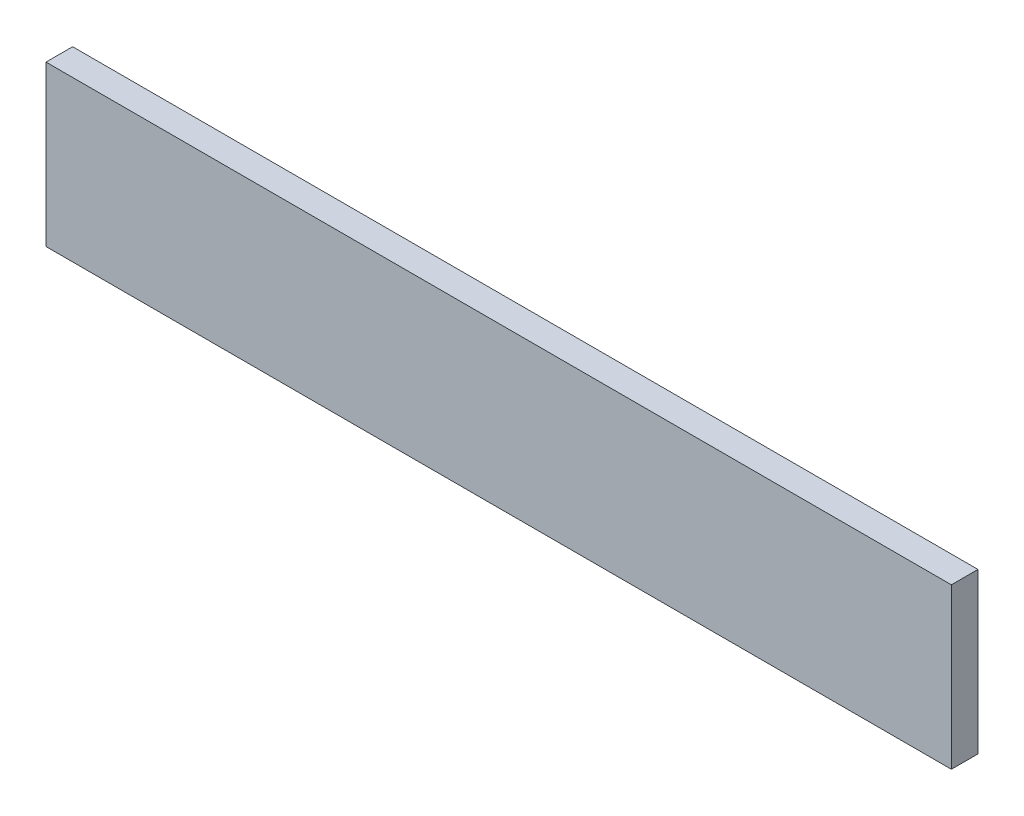
ISO-10303-21;
HEADER;
FILE_DESCRIPTION(('STEP AP214'),'2;1');
FILE_NAME('part.step','',(''),(''),'','','');
FILE_SCHEMA(('AUTOMOTIVE_DESIGN { 1 0 10303 214 1 1 1 1 }'));
ENDSEC;
DATA;
#1=APPLICATION_CONTEXT('core data for automotive mechanical design processes');
#2=APPLICATION_PROTOCOL_DEFINITION('international standard','automotive_design',2000,#1);
#3=PRODUCT_CONTEXT('',#1,'mechanical');
#4=PRODUCT('Part','Part','',(#3));
#5=PRODUCT_RELATED_PRODUCT_CATEGORY('part','',(#4));
#6=PRODUCT_DEFINITION_FORMATION('','',#4);
#7=PRODUCT_DEFINITION_CONTEXT('part definition',#1,'design');
#8=PRODUCT_DEFINITION('design','',#6,#7);
#9=PRODUCT_DEFINITION_SHAPE('','',#8);
#10=(LENGTH_UNIT() NAMED_UNIT(*) SI_UNIT(.MILLI.,.METRE.));
#11=(NAMED_UNIT(*) PLANE_ANGLE_UNIT() SI_UNIT($,.RADIAN.));
#12=(NAMED_UNIT(*) SI_UNIT($,.STERADIAN.) SOLID_ANGLE_UNIT());
#13=UNCERTAINTY_MEASURE_WITH_UNIT(LENGTH_MEASURE(1.E-05),#10,'distance_accuracy_value','');
#14=(GEOMETRIC_REPRESENTATION_CONTEXT(3) GLOBAL_UNCERTAINTY_ASSIGNED_CONTEXT((#13)) GLOBAL_UNIT_ASSIGNED_CONTEXT((#10,
#11,#12)) REPRESENTATION_CONTEXT('',''));
#15=CARTESIAN_POINT('',(0.,0.,0.));
#16=DIRECTION('',(0.,0.,1.));
#17=DIRECTION('',(1.,0.,0.));
#18=AXIS2_PLACEMENT_3D('',#15,#16,#17);
#19=CARTESIAN_POINT('',(0.,0.,6.35));
#20=DIRECTION('',(1.,0.,0.));
#21=DIRECTION('',(0.,0.,-1.));
#22=AXIS2_PLACEMENT_3D('',#19,#20,#21);
#23=PLANE('',#22);
#24=DIRECTION('',(0.,-1.,0.));
#25=VECTOR('',#24,1.);
#26=CARTESIAN_POINT('',(0.,0.,0.));
#27=LINE('',#26,#25);
#28=CARTESIAN_POINT('',(0.,38.1,0.));
#29=VERTEX_POINT('',#28);
#30=CARTESIAN_POINT('',(0.,0.,0.));
#31=VERTEX_POINT('',#30);
#32=EDGE_CURVE('E96',#29,#31,#27,.T.);
#33=ORIENTED_EDGE('',*,*,#32,.T.);
#34=DIRECTION('',(0.,0.,-1.));
#35=VECTOR('',#34,1.);
#36=CARTESIAN_POINT('',(0.,0.,6.35));
#37=LINE('',#36,#35);
#38=CARTESIAN_POINT('',(0.,0.,6.35));
#39=VERTEX_POINT('',#38);
#40=EDGE_CURVE('E11',#39,#31,#37,.T.);
#41=ORIENTED_EDGE('',*,*,#40,.F.);
#42=DIRECTION('',(0.,-1.,0.));
#43=VECTOR('',#42,1.);
#44=CARTESIAN_POINT('',(0.,0.,6.35));
#45=LINE('',#44,#43);
#46=CARTESIAN_POINT('',(0.,38.1,6.35));
#47=VERTEX_POINT('',#46);
#48=EDGE_CURVE('E84',#47,#39,#45,.T.);
#49=ORIENTED_EDGE('',*,*,#48,.F.);
#50=DIRECTION('',(0.,0.,-1.));
#51=VECTOR('',#50,1.);
#52=CARTESIAN_POINT('',(0.,38.1,6.35));
#53=LINE('',#52,#51);
#54=EDGE_CURVE('E92',#47,#29,#53,.T.);
#55=ORIENTED_EDGE('',*,*,#54,.T.);
#56=EDGE_LOOP('',(#33,#41,#49,#55));
#57=FACE_BOUND('',#56,.T.);
#58=ADVANCED_FACE('F33',(#57),#23,.F.);
#59=CARTESIAN_POINT('',(0.,0.,6.35));
#60=DIRECTION('',(0.,1.,0.));
#61=DIRECTION('',(0.,0.,1.));
#62=AXIS2_PLACEMENT_3D('',#59,#60,#61);
#63=PLANE('',#62);
#64=DIRECTION('',(1.,0.,0.));
#65=VECTOR('',#64,1.);
#66=CARTESIAN_POINT('',(0.,0.,0.));
#67=LINE('',#66,#65);
#68=CARTESIAN_POINT('',(215.9,0.,0.));
#69=VERTEX_POINT('',#68);
#70=EDGE_CURVE('E88',#31,#69,#67,.T.);
#71=ORIENTED_EDGE('',*,*,#70,.T.);
#72=DIRECTION('',(0.,0.,-1.));
#73=VECTOR('',#72,1.);
#74=CARTESIAN_POINT('',(215.9,0.,6.35));
#75=LINE('',#74,#73);
#76=CARTESIAN_POINT('',(215.9,0.,6.35));
#77=VERTEX_POINT('',#76);
#78=EDGE_CURVE('E41',#77,#69,#75,.T.);
#79=ORIENTED_EDGE('',*,*,#78,.F.);
#80=DIRECTION('',(1.,0.,0.));
#81=VECTOR('',#80,1.);
#82=CARTESIAN_POINT('',(0.,0.,6.35));
#83=LINE('',#82,#81);
#84=EDGE_CURVE('E79',#39,#77,#83,.T.);
#85=ORIENTED_EDGE('',*,*,#84,.F.);
#86=ORIENTED_EDGE('',*,*,#40,.T.);
#87=EDGE_LOOP('',(#71,#79,#85,#86));
#88=FACE_BOUND('',#87,.T.);
#89=ADVANCED_FACE('F87',(#88),#63,.F.);
#90=CARTESIAN_POINT('',(215.9,0.,6.35));
#91=DIRECTION('',(-1.,0.,0.));
#92=DIRECTION('',(0.,0.,1.));
#93=AXIS2_PLACEMENT_3D('',#90,#91,#92);
#94=PLANE('',#93);
#95=DIRECTION('',(0.,1.,0.));
#96=VECTOR('',#95,1.);
#97=CARTESIAN_POINT('',(215.9,0.,0.));
#98=LINE('',#97,#96);
#99=CARTESIAN_POINT('',(215.9,38.1,0.));
#100=VERTEX_POINT('',#99);
#101=EDGE_CURVE('E66',#69,#100,#98,.T.);
#102=ORIENTED_EDGE('',*,*,#101,.T.);
#103=DIRECTION('',(0.,0.,-1.));
#104=VECTOR('',#103,1.);
#105=CARTESIAN_POINT('',(215.9,38.1,6.35));
#106=LINE('',#105,#104);
#107=CARTESIAN_POINT('',(215.9,38.1,6.35));
#108=VERTEX_POINT('',#107);
#109=EDGE_CURVE('E89',#108,#100,#106,.T.);
#110=ORIENTED_EDGE('',*,*,#109,.F.);
#111=DIRECTION('',(0.,1.,0.));
#112=VECTOR('',#111,1.);
#113=CARTESIAN_POINT('',(215.9,0.,6.35));
#114=LINE('',#113,#112);
#115=EDGE_CURVE('E82',#77,#108,#114,.T.);
#116=ORIENTED_EDGE('',*,*,#115,.F.);
#117=ORIENTED_EDGE('',*,*,#78,.T.);
#118=EDGE_LOOP('',(#102,#110,#116,#117));
#119=FACE_BOUND('',#118,.T.);
#120=ADVANCED_FACE('F90',(#119),#94,.F.);
#121=CARTESIAN_POINT('',(0.,38.1,6.35));
#122=DIRECTION('',(0.,-1.,0.));
#123=DIRECTION('',(0.,0.,-1.));
#124=AXIS2_PLACEMENT_3D('',#121,#122,#123);
#125=PLANE('',#124);
#126=DIRECTION('',(-1.,0.,0.));
#127=VECTOR('',#126,1.);
#128=CARTESIAN_POINT('',(0.,38.1,0.));
#129=LINE('',#128,#127);
#130=EDGE_CURVE('E72',#100,#29,#129,.T.);
#131=ORIENTED_EDGE('',*,*,#130,.T.);
#132=ORIENTED_EDGE('',*,*,#54,.F.);
#133=DIRECTION('',(-1.,0.,0.));
#134=VECTOR('',#133,1.);
#135=CARTESIAN_POINT('',(0.,38.1,6.35));
#136=LINE('',#135,#134);
#137=EDGE_CURVE('E49',#108,#47,#136,.T.);
#138=ORIENTED_EDGE('',*,*,#137,.F.);
#139=ORIENTED_EDGE('',*,*,#109,.T.);
#140=EDGE_LOOP('',(#131,#132,#138,#139));
#141=FACE_BOUND('',#140,.T.);
#142=ADVANCED_FACE('F103',(#141),#125,.F.);
#143=CARTESIAN_POINT('',(0.,0.,6.35));
#144=DIRECTION('',(0.,0.,-1.));
#145=DIRECTION('',(-1.,0.,0.));
#146=AXIS2_PLACEMENT_3D('',#143,#144,#145);
#147=PLANE('',#146);
#148=ORIENTED_EDGE('',*,*,#48,.T.);
#149=ORIENTED_EDGE('',*,*,#84,.T.);
#150=ORIENTED_EDGE('',*,*,#115,.T.);
#151=ORIENTED_EDGE('',*,*,#137,.T.);
#152=EDGE_LOOP('',(#148,#149,#150,#151));
#153=FACE_BOUND('',#152,.T.);
#154=ADVANCED_FACE('F80',(#153),#147,.F.);
#155=CARTESIAN_POINT('',(0.,0.,0.));
#156=DIRECTION('',(0.,0.,-1.));
#157=DIRECTION('',(-1.,0.,0.));
#158=AXIS2_PLACEMENT_3D('',#155,#156,#157);
#159=PLANE('',#158);
#160=ORIENTED_EDGE('',*,*,#32,.F.);
#161=ORIENTED_EDGE('',*,*,#130,.F.);
#162=ORIENTED_EDGE('',*,*,#101,.F.);
#163=ORIENTED_EDGE('',*,*,#70,.F.);
#164=EDGE_LOOP('',(#160,#161,#162,#163));
#165=FACE_BOUND('',#164,.T.);
#166=ADVANCED_FACE('F106',(#165),#159,.T.);
#167=CLOSED_SHELL('',(#58,#89,#120,#142,#154,#166));
#168=MANIFOLD_SOLID_BREP('B2',#167);
#169=ADVANCED_BREP_SHAPE_REPRESENTATION('',(#18,#168),#14);
#170=SHAPE_DEFINITION_REPRESENTATION(#9,#169);
ENDSEC;
END-ISO-10303-21;
